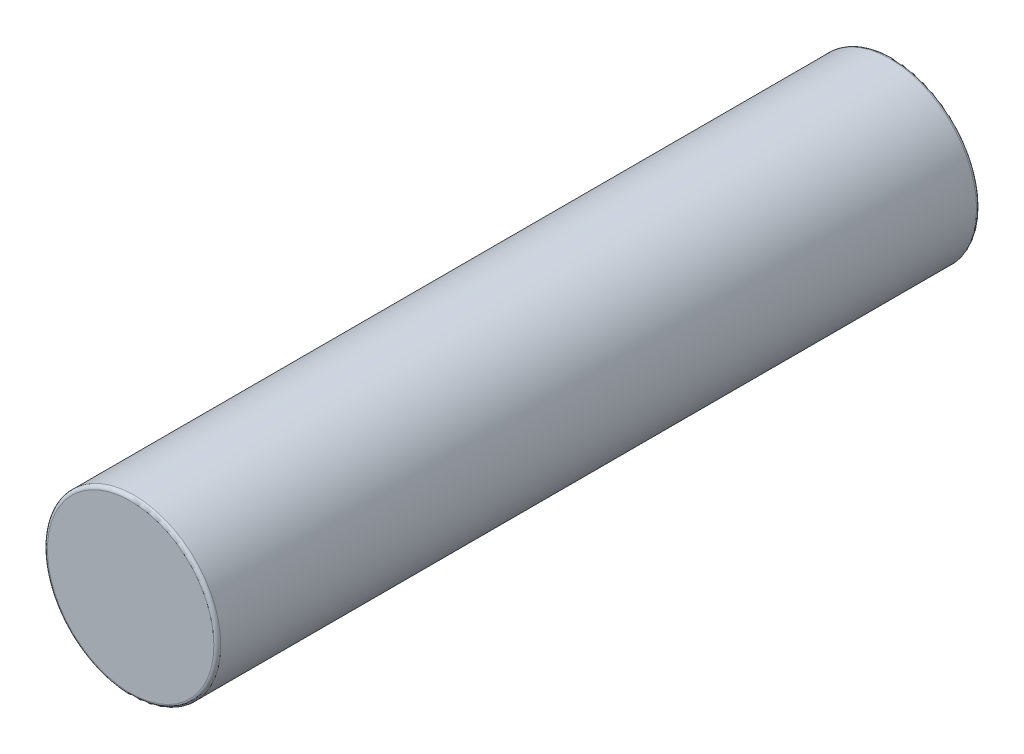
ISO-10303-21;
HEADER;
FILE_DESCRIPTION(('STEP AP214'),'2;1');
FILE_NAME('part.step','',(''),(''),'','','');
FILE_SCHEMA(('AUTOMOTIVE_DESIGN { 1 0 10303 214 1 1 1 1 }'));
ENDSEC;
DATA;
#1=APPLICATION_CONTEXT('core data for automotive mechanical design processes');
#2=APPLICATION_PROTOCOL_DEFINITION('international standard','automotive_design',2000,#1);
#3=PRODUCT_CONTEXT('',#1,'mechanical');
#4=PRODUCT('Part','Part','',(#3));
#5=PRODUCT_RELATED_PRODUCT_CATEGORY('part','',(#4));
#6=PRODUCT_DEFINITION_FORMATION('','',#4);
#7=PRODUCT_DEFINITION_CONTEXT('part definition',#1,'design');
#8=PRODUCT_DEFINITION('design','',#6,#7);
#9=PRODUCT_DEFINITION_SHAPE('','',#8);
#10=(LENGTH_UNIT() NAMED_UNIT(*) SI_UNIT(.MILLI.,.METRE.));
#11=(NAMED_UNIT(*) PLANE_ANGLE_UNIT() SI_UNIT($,.RADIAN.));
#12=(NAMED_UNIT(*) SI_UNIT($,.STERADIAN.) SOLID_ANGLE_UNIT());
#13=UNCERTAINTY_MEASURE_WITH_UNIT(LENGTH_MEASURE(1.E-05),#10,'distance_accuracy_value','');
#14=(GEOMETRIC_REPRESENTATION_CONTEXT(3) GLOBAL_UNCERTAINTY_ASSIGNED_CONTEXT((#13)) GLOBAL_UNIT_ASSIGNED_CONTEXT((#10,
#11,#12)) REPRESENTATION_CONTEXT('',''));
#15=CARTESIAN_POINT('',(0.,0.,0.));
#16=DIRECTION('',(0.,0.,1.));
#17=DIRECTION('',(1.,0.,0.));
#18=AXIS2_PLACEMENT_3D('',#15,#16,#17);
#19=CARTESIAN_POINT('',(0.,0.,11.));
#20=DIRECTION('',(0.,0.,-1.));
#21=DIRECTION('',(-1.,0.,0.));
#22=AXIS2_PLACEMENT_3D('',#19,#20,#21);
#23=CYLINDRICAL_SURFACE('',#22,1.25);
#24=CARTESIAN_POINT('',(0.,0.,0.0499999999999997));
#25=DIRECTION('',(0.,0.,1.));
#26=DIRECTION('',(1.,0.,0.));
#27=AXIS2_PLACEMENT_3D('',#24,#25,#26);
#28=CIRCLE('',#27,1.25);
#29=CARTESIAN_POINT('',(1.25,0.,0.0499999999999997));
#30=VERTEX_POINT('',#29);
#31=EDGE_CURVE('E42',#30,#30,#28,.T.);
#32=ORIENTED_EDGE('',*,*,#31,.T.);
#33=EDGE_LOOP('',(#32));
#34=FACE_BOUND('',#33,.T.);
#35=CARTESIAN_POINT('',(0.,0.,10.95));
#36=DIRECTION('',(0.,0.,1.));
#37=DIRECTION('',(1.,0.,0.));
#38=AXIS2_PLACEMENT_3D('',#35,#36,#37);
#39=CIRCLE('',#38,1.25);
#40=CARTESIAN_POINT('',(1.25,0.,10.95));
#41=VERTEX_POINT('',#40);
#42=EDGE_CURVE('E46',#41,#41,#39,.F.);
#43=ORIENTED_EDGE('',*,*,#42,.T.);
#44=EDGE_LOOP('',(#43));
#45=FACE_BOUND('',#44,.T.);
#46=ADVANCED_FACE('F31',(#34,#45),#23,.T.);
#47=CARTESIAN_POINT('',(0.,0.,11.));
#48=DIRECTION('',(0.,0.,1.));
#49=DIRECTION('',(1.,0.,0.));
#50=AXIS2_PLACEMENT_3D('',#47,#48,#49);
#51=PLANE('',#50);
#52=CARTESIAN_POINT('',(0.,0.,11.));
#53=DIRECTION('',(0.,0.,1.));
#54=DIRECTION('',(1.,0.,0.));
#55=AXIS2_PLACEMENT_3D('',#52,#53,#54);
#56=CIRCLE('',#55,1.2);
#57=CARTESIAN_POINT('',(1.2,0.,11.));
#58=VERTEX_POINT('',#57);
#59=EDGE_CURVE('E10',#58,#58,#56,.T.);
#60=ORIENTED_EDGE('',*,*,#59,.T.);
#61=EDGE_LOOP('',(#60));
#62=FACE_BOUND('',#61,.T.);
#63=ADVANCED_FACE('F62',(#62),#51,.T.);
#64=CARTESIAN_POINT('',(0.,0.,0.));
#65=DIRECTION('',(0.,0.,1.));
#66=DIRECTION('',(1.,0.,0.));
#67=AXIS2_PLACEMENT_3D('',#64,#65,#66);
#68=PLANE('',#67);
#69=CARTESIAN_POINT('',(0.,0.,0.));
#70=DIRECTION('',(0.,0.,1.));
#71=DIRECTION('',(1.,0.,0.));
#72=AXIS2_PLACEMENT_3D('',#69,#70,#71);
#73=CIRCLE('',#72,1.2);
#74=CARTESIAN_POINT('',(1.2,0.,0.));
#75=VERTEX_POINT('',#74);
#76=EDGE_CURVE('E38',#75,#75,#73,.F.);
#77=ORIENTED_EDGE('',*,*,#76,.T.);
#78=EDGE_LOOP('',(#77));
#79=FACE_BOUND('',#78,.T.);
#80=ADVANCED_FACE('F59',(#79),#68,.F.);
#81=CARTESIAN_POINT('',(0.,0.,0.0499999999999997));
#82=DIRECTION('',(0.,0.,1.));
#83=DIRECTION('',(1.,0.,0.));
#84=AXIS2_PLACEMENT_3D('',#81,#82,#83);
#85=TOROIDAL_SURFACE('',#84,1.2,0.05);
#86=ORIENTED_EDGE('',*,*,#76,.F.);
#87=EDGE_LOOP('',(#86));
#88=FACE_BOUND('',#87,.T.);
#89=ORIENTED_EDGE('',*,*,#31,.F.);
#90=EDGE_LOOP('',(#89));
#91=FACE_BOUND('',#90,.T.);
#92=ADVANCED_FACE('F55',(#88,#91),#85,.T.);
#93=CARTESIAN_POINT('',(0.,0.,10.95));
#94=DIRECTION('',(0.,0.,1.));
#95=DIRECTION('',(1.,0.,0.));
#96=AXIS2_PLACEMENT_3D('',#93,#94,#95);
#97=TOROIDAL_SURFACE('',#96,1.2,0.05);
#98=ORIENTED_EDGE('',*,*,#42,.F.);
#99=EDGE_LOOP('',(#98));
#100=FACE_BOUND('',#99,.T.);
#101=ORIENTED_EDGE('',*,*,#59,.F.);
#102=EDGE_LOOP('',(#101));
#103=FACE_BOUND('',#102,.T.);
#104=ADVANCED_FACE('F33',(#100,#103),#97,.T.);
#105=CLOSED_SHELL('',(#46,#63,#80,#92,#104));
#106=MANIFOLD_SOLID_BREP('B2',#105);
#107=ADVANCED_BREP_SHAPE_REPRESENTATION('',(#18,#106),#14);
#108=SHAPE_DEFINITION_REPRESENTATION(#9,#107);
ENDSEC;
END-ISO-10303-21;
